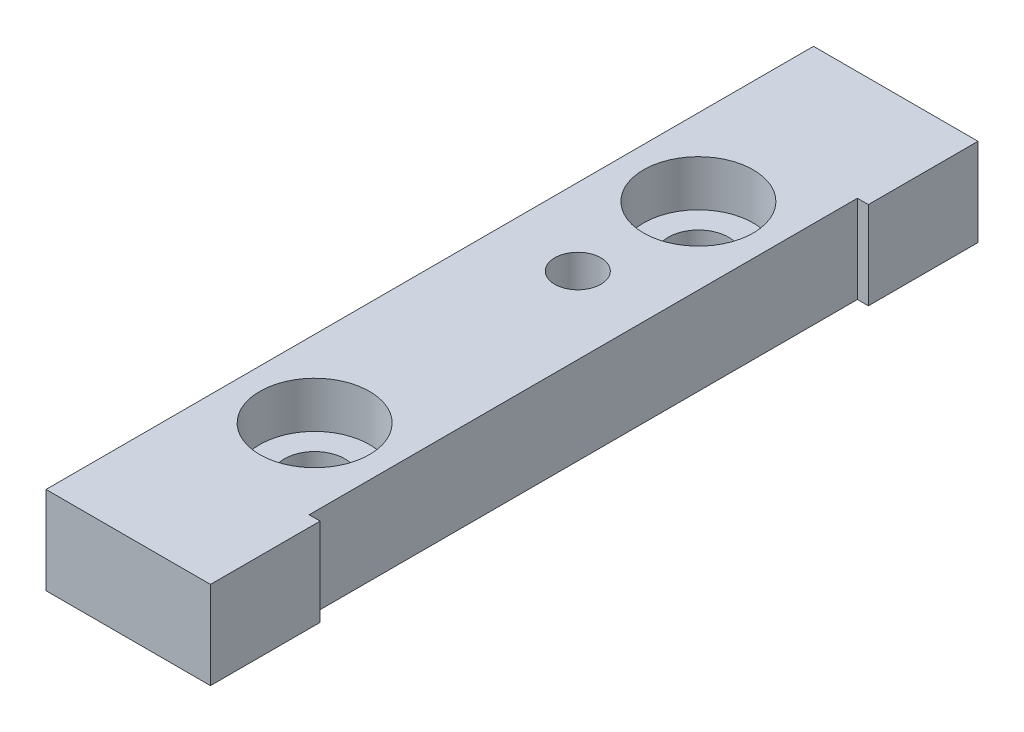
ISO-10303-21;
HEADER;
FILE_DESCRIPTION(('STEP AP214'),'2;1');
FILE_NAME('part.step','',(''),(''),'','','');
FILE_SCHEMA(('AUTOMOTIVE_DESIGN { 1 0 10303 214 1 1 1 1 }'));
ENDSEC;
DATA;
#1=APPLICATION_CONTEXT('core data for automotive mechanical design processes');
#2=APPLICATION_PROTOCOL_DEFINITION('international standard','automotive_design',2000,#1);
#3=PRODUCT_CONTEXT('',#1,'mechanical');
#4=PRODUCT('Part','Part','',(#3));
#5=PRODUCT_RELATED_PRODUCT_CATEGORY('part','',(#4));
#6=PRODUCT_DEFINITION_FORMATION('','',#4);
#7=PRODUCT_DEFINITION_CONTEXT('part definition',#1,'design');
#8=PRODUCT_DEFINITION('design','',#6,#7);
#9=PRODUCT_DEFINITION_SHAPE('','',#8);
#10=(LENGTH_UNIT() NAMED_UNIT(*) SI_UNIT(.MILLI.,.METRE.));
#11=(NAMED_UNIT(*) PLANE_ANGLE_UNIT() SI_UNIT($,.RADIAN.));
#12=(NAMED_UNIT(*) SI_UNIT($,.STERADIAN.) SOLID_ANGLE_UNIT());
#13=UNCERTAINTY_MEASURE_WITH_UNIT(LENGTH_MEASURE(1.E-05),#10,'distance_accuracy_value','');
#14=(GEOMETRIC_REPRESENTATION_CONTEXT(3) GLOBAL_UNCERTAINTY_ASSIGNED_CONTEXT((#13)) GLOBAL_UNIT_ASSIGNED_CONTEXT((#10,
#11,#12)) REPRESENTATION_CONTEXT('',''));
#15=CARTESIAN_POINT('',(0.,0.,0.));
#16=DIRECTION('',(0.,0.,1.));
#17=DIRECTION('',(1.,0.,0.));
#18=AXIS2_PLACEMENT_3D('',#15,#16,#17);
#19=CARTESIAN_POINT('',(-0.499999999999999,0.,-17.5));
#20=DIRECTION('',(0.,1.,0.));
#21=DIRECTION('',(0.,0.,1.));
#22=AXIS2_PLACEMENT_3D('',#19,#20,#21);
#23=CYLINDRICAL_SURFACE('',#22,2.75);
#24=CARTESIAN_POINT('',(-0.499999999999999,0.,-17.5));
#25=DIRECTION('',(0.,1.,0.));
#26=DIRECTION('',(0.,0.,1.));
#27=AXIS2_PLACEMENT_3D('',#24,#25,#26);
#28=CIRCLE('',#27,2.75);
#29=CARTESIAN_POINT('',(-0.499999999999999,0.,-14.75));
#30=VERTEX_POINT('',#29);
#31=EDGE_CURVE('E195',#30,#30,#28,.T.);
#32=ORIENTED_EDGE('',*,*,#31,.F.);
#33=EDGE_LOOP('',(#32));
#34=FACE_BOUND('',#33,.T.);
#35=CARTESIAN_POINT('',(-0.499999999999999,3.8,-17.5));
#36=DIRECTION('',(0.,1.,0.));
#37=DIRECTION('',(0.,0.,1.));
#38=AXIS2_PLACEMENT_3D('',#35,#36,#37);
#39=CIRCLE('',#38,2.75);
#40=CARTESIAN_POINT('',(-0.499999999999999,3.8,-14.75));
#41=VERTEX_POINT('',#40);
#42=EDGE_CURVE('E46',#41,#41,#39,.F.);
#43=ORIENTED_EDGE('',*,*,#42,.F.);
#44=EDGE_LOOP('',(#43));
#45=FACE_BOUND('',#44,.T.);
#46=ADVANCED_FACE('F42',(#34,#45),#23,.F.);
#47=CARTESIAN_POINT('',(-0.499999999999999,0.,17.5));
#48=DIRECTION('',(0.,1.,0.));
#49=DIRECTION('',(0.,0.,1.));
#50=AXIS2_PLACEMENT_3D('',#47,#48,#49);
#51=CYLINDRICAL_SURFACE('',#50,2.75);
#52=CARTESIAN_POINT('',(-0.499999999999999,0.,17.5));
#53=DIRECTION('',(0.,1.,0.));
#54=DIRECTION('',(0.,0.,1.));
#55=AXIS2_PLACEMENT_3D('',#52,#53,#54);
#56=CIRCLE('',#55,2.75);
#57=CARTESIAN_POINT('',(-0.499999999999999,0.,20.25));
#58=VERTEX_POINT('',#57);
#59=EDGE_CURVE('E151',#58,#58,#56,.T.);
#60=ORIENTED_EDGE('',*,*,#59,.F.);
#61=EDGE_LOOP('',(#60));
#62=FACE_BOUND('',#61,.T.);
#63=CARTESIAN_POINT('',(-0.499999999999999,3.8,17.5));
#64=DIRECTION('',(0.,1.,0.));
#65=DIRECTION('',(0.,0.,1.));
#66=AXIS2_PLACEMENT_3D('',#63,#64,#65);
#67=CIRCLE('',#66,2.75);
#68=CARTESIAN_POINT('',(-0.499999999999999,3.8,20.25));
#69=VERTEX_POINT('',#68);
#70=EDGE_CURVE('E186',#69,#69,#67,.F.);
#71=ORIENTED_EDGE('',*,*,#70,.F.);
#72=EDGE_LOOP('',(#71));
#73=FACE_BOUND('',#72,.T.);
#74=ADVANCED_FACE('F262',(#62,#73),#51,.F.);
#75=CARTESIAN_POINT('',(7.5,8.,-25.));
#76=DIRECTION('',(-1.,0.,0.));
#77=DIRECTION('',(0.,0.,1.));
#78=AXIS2_PLACEMENT_3D('',#75,#76,#77);
#79=PLANE('',#78);
#80=DIRECTION('',(0.,0.,-1.));
#81=VECTOR('',#80,1.);
#82=CARTESIAN_POINT('',(7.5,0.,-25.));
#83=LINE('',#82,#81);
#84=CARTESIAN_POINT('',(7.5,0.,-25.));
#85=VERTEX_POINT('',#84);
#86=CARTESIAN_POINT('',(7.5,0.,-35.));
#87=VERTEX_POINT('',#86);
#88=EDGE_CURVE('E146',#85,#87,#83,.T.);
#89=ORIENTED_EDGE('',*,*,#88,.T.);
#90=DIRECTION('',(0.,-1.,0.));
#91=VECTOR('',#90,1.);
#92=CARTESIAN_POINT('',(7.5,8.,-35.));
#93=LINE('',#92,#91);
#94=CARTESIAN_POINT('',(7.5,8.,-35.));
#95=VERTEX_POINT('',#94);
#96=EDGE_CURVE('E11',#95,#87,#93,.T.);
#97=ORIENTED_EDGE('',*,*,#96,.F.);
#98=DIRECTION('',(0.,0.,-1.));
#99=VECTOR('',#98,1.);
#100=CARTESIAN_POINT('',(7.5,8.,-25.));
#101=LINE('',#100,#99);
#102=CARTESIAN_POINT('',(7.5,8.,-25.));
#103=VERTEX_POINT('',#102);
#104=EDGE_CURVE('E169',#103,#95,#101,.T.);
#105=ORIENTED_EDGE('',*,*,#104,.F.);
#106=DIRECTION('',(0.,-1.,0.));
#107=VECTOR('',#106,1.);
#108=CARTESIAN_POINT('',(7.5,8.,-25.));
#109=LINE('',#108,#107);
#110=EDGE_CURVE('E142',#103,#85,#109,.T.);
#111=ORIENTED_EDGE('',*,*,#110,.T.);
#112=EDGE_LOOP('',(#89,#97,#105,#111));
#113=FACE_BOUND('',#112,.T.);
#114=ADVANCED_FACE('F44',(#113),#79,.F.);
#115=CARTESIAN_POINT('',(-7.5,8.,-35.));
#116=DIRECTION('',(0.,0.,1.));
#117=DIRECTION('',(1.,0.,0.));
#118=AXIS2_PLACEMENT_3D('',#115,#116,#117);
#119=PLANE('',#118);
#120=DIRECTION('',(-1.,0.,0.));
#121=VECTOR('',#120,1.);
#122=CARTESIAN_POINT('',(-7.5,0.,-35.));
#123=LINE('',#122,#121);
#124=CARTESIAN_POINT('',(-7.5,0.,-35.));
#125=VERTEX_POINT('',#124);
#126=EDGE_CURVE('E150',#87,#125,#123,.T.);
#127=ORIENTED_EDGE('',*,*,#126,.T.);
#128=DIRECTION('',(0.,-1.,0.));
#129=VECTOR('',#128,1.);
#130=CARTESIAN_POINT('',(-7.5,8.,-35.));
#131=LINE('',#130,#129);
#132=CARTESIAN_POINT('',(-7.5,8.,-35.));
#133=VERTEX_POINT('',#132);
#134=EDGE_CURVE('E53',#133,#125,#131,.T.);
#135=ORIENTED_EDGE('',*,*,#134,.F.);
#136=DIRECTION('',(-1.,0.,0.));
#137=VECTOR('',#136,1.);
#138=CARTESIAN_POINT('',(-7.5,8.,-35.));
#139=LINE('',#138,#137);
#140=EDGE_CURVE('E105',#95,#133,#139,.T.);
#141=ORIENTED_EDGE('',*,*,#140,.F.);
#142=ORIENTED_EDGE('',*,*,#96,.T.);
#143=EDGE_LOOP('',(#127,#135,#141,#142));
#144=FACE_BOUND('',#143,.T.);
#145=ADVANCED_FACE('F394',(#144),#119,.F.);
#146=CARTESIAN_POINT('',(-7.5,8.,35.));
#147=DIRECTION('',(1.,0.,0.));
#148=DIRECTION('',(0.,0.,-1.));
#149=AXIS2_PLACEMENT_3D('',#146,#147,#148);
#150=PLANE('',#149);
#151=DIRECTION('',(0.,0.,1.));
#152=VECTOR('',#151,1.);
#153=CARTESIAN_POINT('',(-7.5,0.,35.));
#154=LINE('',#153,#152);
#155=CARTESIAN_POINT('',(-7.5,0.,35.));
#156=VERTEX_POINT('',#155);
#157=EDGE_CURVE('E154',#125,#156,#154,.T.);
#158=ORIENTED_EDGE('',*,*,#157,.T.);
#159=DIRECTION('',(0.,-1.,0.));
#160=VECTOR('',#159,1.);
#161=CARTESIAN_POINT('',(-7.5,8.,35.));
#162=LINE('',#161,#160);
#163=CARTESIAN_POINT('',(-7.5,8.,35.));
#164=VERTEX_POINT('',#163);
#165=EDGE_CURVE('E180',#164,#156,#162,.T.);
#166=ORIENTED_EDGE('',*,*,#165,.F.);
#167=DIRECTION('',(0.,0.,1.));
#168=VECTOR('',#167,1.);
#169=CARTESIAN_POINT('',(-7.5,8.,35.));
#170=LINE('',#169,#168);
#171=EDGE_CURVE('E226',#133,#164,#170,.T.);
#172=ORIENTED_EDGE('',*,*,#171,.F.);
#173=ORIENTED_EDGE('',*,*,#134,.T.);
#174=EDGE_LOOP('',(#158,#166,#172,#173));
#175=FACE_BOUND('',#174,.T.);
#176=ADVANCED_FACE('F385',(#175),#150,.F.);
#177=CARTESIAN_POINT('',(-7.5,8.,35.));
#178=DIRECTION('',(0.,0.,-1.));
#179=DIRECTION('',(-1.,0.,0.));
#180=AXIS2_PLACEMENT_3D('',#177,#178,#179);
#181=PLANE('',#180);
#182=DIRECTION('',(1.,0.,0.));
#183=VECTOR('',#182,1.);
#184=CARTESIAN_POINT('',(-7.5,0.,35.));
#185=LINE('',#184,#183);
#186=CARTESIAN_POINT('',(7.5,0.,35.));
#187=VERTEX_POINT('',#186);
#188=EDGE_CURVE('E157',#156,#187,#185,.T.);
#189=ORIENTED_EDGE('',*,*,#188,.T.);
#190=DIRECTION('',(0.,-1.,0.));
#191=VECTOR('',#190,1.);
#192=CARTESIAN_POINT('',(7.5,8.,35.));
#193=LINE('',#192,#191);
#194=CARTESIAN_POINT('',(7.5,8.,35.));
#195=VERTEX_POINT('',#194);
#196=EDGE_CURVE('E176',#195,#187,#193,.T.);
#197=ORIENTED_EDGE('',*,*,#196,.F.);
#198=DIRECTION('',(1.,0.,0.));
#199=VECTOR('',#198,1.);
#200=CARTESIAN_POINT('',(-7.5,8.,35.));
#201=LINE('',#200,#199);
#202=EDGE_CURVE('E229',#164,#195,#201,.T.);
#203=ORIENTED_EDGE('',*,*,#202,.F.);
#204=ORIENTED_EDGE('',*,*,#165,.T.);
#205=EDGE_LOOP('',(#189,#197,#203,#204));
#206=FACE_BOUND('',#205,.T.);
#207=ADVANCED_FACE('F237',(#206),#181,.F.);
#208=CARTESIAN_POINT('',(7.5,8.,35.));
#209=DIRECTION('',(-1.,0.,0.));
#210=DIRECTION('',(0.,0.,1.));
#211=AXIS2_PLACEMENT_3D('',#208,#209,#210);
#212=PLANE('',#211);
#213=DIRECTION('',(0.,0.,-1.));
#214=VECTOR('',#213,1.);
#215=CARTESIAN_POINT('',(7.5,0.,35.));
#216=LINE('',#215,#214);
#217=CARTESIAN_POINT('',(7.5,0.,25.));
#218=VERTEX_POINT('',#217);
#219=EDGE_CURVE('E160',#187,#218,#216,.T.);
#220=ORIENTED_EDGE('',*,*,#219,.T.);
#221=DIRECTION('',(0.,-1.,0.));
#222=VECTOR('',#221,1.);
#223=CARTESIAN_POINT('',(7.5,8.,25.));
#224=LINE('',#223,#222);
#225=CARTESIAN_POINT('',(7.5,8.,25.));
#226=VERTEX_POINT('',#225);
#227=EDGE_CURVE('E135',#226,#218,#224,.T.);
#228=ORIENTED_EDGE('',*,*,#227,.F.);
#229=DIRECTION('',(0.,0.,-1.));
#230=VECTOR('',#229,1.);
#231=CARTESIAN_POINT('',(7.5,8.,35.));
#232=LINE('',#231,#230);
#233=EDGE_CURVE('E124',#195,#226,#232,.T.);
#234=ORIENTED_EDGE('',*,*,#233,.F.);
#235=ORIENTED_EDGE('',*,*,#196,.T.);
#236=EDGE_LOOP('',(#220,#228,#234,#235));
#237=FACE_BOUND('',#236,.T.);
#238=ADVANCED_FACE('F241',(#237),#212,.F.);
#239=CARTESIAN_POINT('',(6.50000000000001,8.,25.));
#240=DIRECTION('',(0.,0.,1.));
#241=DIRECTION('',(1.,0.,0.));
#242=AXIS2_PLACEMENT_3D('',#239,#240,#241);
#243=PLANE('',#242);
#244=DIRECTION('',(-1.,0.,0.));
#245=VECTOR('',#244,1.);
#246=CARTESIAN_POINT('',(6.50000000000001,0.,25.));
#247=LINE('',#246,#245);
#248=CARTESIAN_POINT('',(6.50000000000001,0.,25.));
#249=VERTEX_POINT('',#248);
#250=EDGE_CURVE('E133',#218,#249,#247,.T.);
#251=ORIENTED_EDGE('',*,*,#250,.T.);
#252=DIRECTION('',(0.,-1.,0.));
#253=VECTOR('',#252,1.);
#254=CARTESIAN_POINT('',(6.50000000000001,8.,25.));
#255=LINE('',#254,#253);
#256=CARTESIAN_POINT('',(6.50000000000001,8.,25.));
#257=VERTEX_POINT('',#256);
#258=EDGE_CURVE('E130',#257,#249,#255,.T.);
#259=ORIENTED_EDGE('',*,*,#258,.F.);
#260=DIRECTION('',(-1.,0.,0.));
#261=VECTOR('',#260,1.);
#262=CARTESIAN_POINT('',(6.50000000000001,8.,25.));
#263=LINE('',#262,#261);
#264=EDGE_CURVE('E118',#226,#257,#263,.T.);
#265=ORIENTED_EDGE('',*,*,#264,.F.);
#266=ORIENTED_EDGE('',*,*,#227,.T.);
#267=EDGE_LOOP('',(#251,#259,#265,#266));
#268=FACE_BOUND('',#267,.T.);
#269=ADVANCED_FACE('F131',(#268),#243,.F.);
#270=CARTESIAN_POINT('',(6.5,8.,-25.));
#271=DIRECTION('',(-1.,0.,0.));
#272=DIRECTION('',(0.,0.,1.));
#273=AXIS2_PLACEMENT_3D('',#270,#271,#272);
#274=PLANE('',#273);
#275=DIRECTION('',(0.,0.,-1.));
#276=VECTOR('',#275,1.);
#277=CARTESIAN_POINT('',(6.5,0.,-25.));
#278=LINE('',#277,#276);
#279=CARTESIAN_POINT('',(6.5,0.,-25.));
#280=VERTEX_POINT('',#279);
#281=EDGE_CURVE('E91',#249,#280,#278,.T.);
#282=ORIENTED_EDGE('',*,*,#281,.T.);
#283=DIRECTION('',(0.,-1.,0.));
#284=VECTOR('',#283,1.);
#285=CARTESIAN_POINT('',(6.5,8.,-25.));
#286=LINE('',#285,#284);
#287=CARTESIAN_POINT('',(6.5,8.,-25.));
#288=VERTEX_POINT('',#287);
#289=EDGE_CURVE('E136',#288,#280,#286,.T.);
#290=ORIENTED_EDGE('',*,*,#289,.F.);
#291=DIRECTION('',(0.,0.,-1.));
#292=VECTOR('',#291,1.);
#293=CARTESIAN_POINT('',(6.5,8.,-25.));
#294=LINE('',#293,#292);
#295=EDGE_CURVE('E122',#257,#288,#294,.T.);
#296=ORIENTED_EDGE('',*,*,#295,.F.);
#297=ORIENTED_EDGE('',*,*,#258,.T.);
#298=EDGE_LOOP('',(#282,#290,#296,#297));
#299=FACE_BOUND('',#298,.T.);
#300=ADVANCED_FACE('F138',(#299),#274,.F.);
#301=CARTESIAN_POINT('',(7.5,8.,-25.));
#302=DIRECTION('',(0.,0.,-1.));
#303=DIRECTION('',(-1.,0.,0.));
#304=AXIS2_PLACEMENT_3D('',#301,#302,#303);
#305=PLANE('',#304);
#306=DIRECTION('',(1.,0.,0.));
#307=VECTOR('',#306,1.);
#308=CARTESIAN_POINT('',(7.5,0.,-25.));
#309=LINE('',#308,#307);
#310=EDGE_CURVE('E97',#280,#85,#309,.T.);
#311=ORIENTED_EDGE('',*,*,#310,.T.);
#312=ORIENTED_EDGE('',*,*,#110,.F.);
#313=DIRECTION('',(1.,0.,0.));
#314=VECTOR('',#313,1.);
#315=CARTESIAN_POINT('',(7.5,8.,-25.));
#316=LINE('',#315,#314);
#317=EDGE_CURVE('E62',#288,#103,#316,.T.);
#318=ORIENTED_EDGE('',*,*,#317,.F.);
#319=ORIENTED_EDGE('',*,*,#289,.T.);
#320=EDGE_LOOP('',(#311,#312,#318,#319));
#321=FACE_BOUND('',#320,.T.);
#322=ADVANCED_FACE('F249',(#321),#305,.F.);
#323=CARTESIAN_POINT('',(0.,8.,0.));
#324=DIRECTION('',(0.,-1.,0.));
#325=DIRECTION('',(0.,0.,-1.));
#326=AXIS2_PLACEMENT_3D('',#323,#324,#325);
#327=PLANE('',#326);
#328=CARTESIAN_POINT('',(-0.499999999999999,8.,-6.5));
#329=DIRECTION('',(0.,1.,0.));
#330=DIRECTION('',(0.,0.,1.));
#331=AXIS2_PLACEMENT_3D('',#328,#329,#330);
#332=CIRCLE('',#331,2.09999999999999);
#333=CARTESIAN_POINT('',(-0.499999999999999,8.,-4.40000000000001));
#334=VERTEX_POINT('',#333);
#335=EDGE_CURVE('E292',#334,#334,#332,.T.);
#336=ORIENTED_EDGE('',*,*,#335,.F.);
#337=EDGE_LOOP('',(#336));
#338=FACE_BOUND('',#337,.T.);
#339=CARTESIAN_POINT('',(-0.499999999999999,8.,-17.5));
#340=DIRECTION('',(0.,1.,0.));
#341=DIRECTION('',(0.,0.,1.));
#342=AXIS2_PLACEMENT_3D('',#339,#340,#341);
#343=CIRCLE('',#342,5.);
#344=CARTESIAN_POINT('',(-0.499999999999999,8.,-12.5));
#345=VERTEX_POINT('',#344);
#346=EDGE_CURVE('E197',#345,#345,#343,.T.);
#347=ORIENTED_EDGE('',*,*,#346,.F.);
#348=EDGE_LOOP('',(#347));
#349=FACE_BOUND('',#348,.T.);
#350=CARTESIAN_POINT('',(-0.499999999999999,8.,17.5));
#351=DIRECTION('',(0.,1.,0.));
#352=DIRECTION('',(0.,0.,1.));
#353=AXIS2_PLACEMENT_3D('',#350,#351,#352);
#354=CIRCLE('',#353,5.);
#355=CARTESIAN_POINT('',(-0.499999999999999,8.,22.5));
#356=VERTEX_POINT('',#355);
#357=EDGE_CURVE('E212',#356,#356,#354,.T.);
#358=ORIENTED_EDGE('',*,*,#357,.F.);
#359=EDGE_LOOP('',(#358));
#360=FACE_BOUND('',#359,.T.);
#361=ORIENTED_EDGE('',*,*,#104,.T.);
#362=ORIENTED_EDGE('',*,*,#140,.T.);
#363=ORIENTED_EDGE('',*,*,#171,.T.);
#364=ORIENTED_EDGE('',*,*,#202,.T.);
#365=ORIENTED_EDGE('',*,*,#233,.T.);
#366=ORIENTED_EDGE('',*,*,#264,.T.);
#367=ORIENTED_EDGE('',*,*,#295,.T.);
#368=ORIENTED_EDGE('',*,*,#317,.T.);
#369=EDGE_LOOP('',(#361,#362,#363,#364,#365,#366,#367,#368));
#370=FACE_BOUND('',#369,.T.);
#371=ADVANCED_FACE('F120',(#338,#349,#360,#370),#327,.F.);
#372=CARTESIAN_POINT('',(0.,0.,0.));
#373=DIRECTION('',(0.,-1.,0.));
#374=DIRECTION('',(0.,0.,-1.));
#375=AXIS2_PLACEMENT_3D('',#372,#373,#374);
#376=PLANE('',#375);
#377=CARTESIAN_POINT('',(-0.499999999999999,0.,-6.5));
#378=DIRECTION('',(0.,1.,0.));
#379=DIRECTION('',(0.,0.,1.));
#380=AXIS2_PLACEMENT_3D('',#377,#378,#379);
#381=CIRCLE('',#380,2.1);
#382=CARTESIAN_POINT('',(-0.499999999999999,0.,-4.4));
#383=VERTEX_POINT('',#382);
#384=EDGE_CURVE('E206',#383,#383,#381,.T.);
#385=ORIENTED_EDGE('',*,*,#384,.T.);
#386=EDGE_LOOP('',(#385));
#387=FACE_BOUND('',#386,.T.);
#388=ORIENTED_EDGE('',*,*,#59,.T.);
#389=EDGE_LOOP('',(#388));
#390=FACE_BOUND('',#389,.T.);
#391=ORIENTED_EDGE('',*,*,#31,.T.);
#392=EDGE_LOOP('',(#391));
#393=FACE_BOUND('',#392,.T.);
#394=ORIENTED_EDGE('',*,*,#88,.F.);
#395=ORIENTED_EDGE('',*,*,#310,.F.);
#396=ORIENTED_EDGE('',*,*,#281,.F.);
#397=ORIENTED_EDGE('',*,*,#250,.F.);
#398=ORIENTED_EDGE('',*,*,#219,.F.);
#399=ORIENTED_EDGE('',*,*,#188,.F.);
#400=ORIENTED_EDGE('',*,*,#157,.F.);
#401=ORIENTED_EDGE('',*,*,#126,.F.);
#402=EDGE_LOOP('',(#394,#395,#396,#397,#398,#399,#400,#401));
#403=FACE_BOUND('',#402,.T.);
#404=ADVANCED_FACE('F244',(#387,#390,#393,#403),#376,.T.);
#405=CARTESIAN_POINT('',(-0.499999999999999,3.8,17.5));
#406=DIRECTION('',(0.,1.,0.));
#407=DIRECTION('',(0.,0.,1.));
#408=AXIS2_PLACEMENT_3D('',#405,#406,#407);
#409=PLANE('',#408);
#410=CARTESIAN_POINT('',(-0.499999999999999,3.8,17.5));
#411=DIRECTION('',(0.,1.,0.));
#412=DIRECTION('',(0.,0.,1.));
#413=AXIS2_PLACEMENT_3D('',#410,#411,#412);
#414=CIRCLE('',#413,5.);
#415=CARTESIAN_POINT('',(-0.499999999999999,3.8,22.5));
#416=VERTEX_POINT('',#415);
#417=EDGE_CURVE('E203',#416,#416,#414,.T.);
#418=ORIENTED_EDGE('',*,*,#417,.T.);
#419=EDGE_LOOP('',(#418));
#420=FACE_BOUND('',#419,.T.);
#421=ORIENTED_EDGE('',*,*,#70,.T.);
#422=EDGE_LOOP('',(#421));
#423=FACE_BOUND('',#422,.T.);
#424=ADVANCED_FACE('F274',(#420,#423),#409,.T.);
#425=CARTESIAN_POINT('',(-0.499999999999999,3.8,17.5));
#426=DIRECTION('',(0.,1.,0.));
#427=DIRECTION('',(0.,0.,1.));
#428=AXIS2_PLACEMENT_3D('',#425,#426,#427);
#429=CYLINDRICAL_SURFACE('',#428,5.);
#430=ORIENTED_EDGE('',*,*,#417,.F.);
#431=EDGE_LOOP('',(#430));
#432=FACE_BOUND('',#431,.T.);
#433=ORIENTED_EDGE('',*,*,#357,.T.);
#434=EDGE_LOOP('',(#433));
#435=FACE_BOUND('',#434,.T.);
#436=ADVANCED_FACE('F281',(#432,#435),#429,.F.);
#437=CARTESIAN_POINT('',(-0.499999999999999,3.8,-17.5));
#438=DIRECTION('',(0.,1.,0.));
#439=DIRECTION('',(0.,0.,1.));
#440=AXIS2_PLACEMENT_3D('',#437,#438,#439);
#441=PLANE('',#440);
#442=CARTESIAN_POINT('',(-0.499999999999999,3.8,-17.5));
#443=DIRECTION('',(0.,1.,0.));
#444=DIRECTION('',(0.,0.,1.));
#445=AXIS2_PLACEMENT_3D('',#442,#443,#444);
#446=CIRCLE('',#445,5.);
#447=CARTESIAN_POINT('',(-0.499999999999999,3.8,-12.5));
#448=VERTEX_POINT('',#447);
#449=EDGE_CURVE('E189',#448,#448,#446,.T.);
#450=ORIENTED_EDGE('',*,*,#449,.T.);
#451=EDGE_LOOP('',(#450));
#452=FACE_BOUND('',#451,.T.);
#453=ORIENTED_EDGE('',*,*,#42,.T.);
#454=EDGE_LOOP('',(#453));
#455=FACE_BOUND('',#454,.T.);
#456=ADVANCED_FACE('F304',(#452,#455),#441,.T.);
#457=CARTESIAN_POINT('',(-0.499999999999999,3.8,-17.5));
#458=DIRECTION('',(0.,1.,0.));
#459=DIRECTION('',(0.,0.,1.));
#460=AXIS2_PLACEMENT_3D('',#457,#458,#459);
#461=CYLINDRICAL_SURFACE('',#460,5.);
#462=ORIENTED_EDGE('',*,*,#449,.F.);
#463=EDGE_LOOP('',(#462));
#464=FACE_BOUND('',#463,.T.);
#465=ORIENTED_EDGE('',*,*,#346,.T.);
#466=EDGE_LOOP('',(#465));
#467=FACE_BOUND('',#466,.T.);
#468=ADVANCED_FACE('F309',(#464,#467),#461,.F.);
#469=CARTESIAN_POINT('',(-0.499999999999999,8.,-6.5));
#470=DIRECTION('',(0.,1.,0.));
#471=DIRECTION('',(0.,0.,1.));
#472=AXIS2_PLACEMENT_3D('',#469,#470,#471);
#473=CYLINDRICAL_SURFACE('',#472,2.09999999999999);
#474=ORIENTED_EDGE('',*,*,#384,.F.);
#475=EDGE_LOOP('',(#474));
#476=FACE_BOUND('',#475,.T.);
#477=ORIENTED_EDGE('',*,*,#335,.T.);
#478=EDGE_LOOP('',(#477));
#479=FACE_BOUND('',#478,.T.);
#480=ADVANCED_FACE('F297',(#476,#479),#473,.F.);
#481=CLOSED_SHELL('',(#46,#74,#114,#145,#176,#207,#238,#269,#300,#322,#371,#404,#424,#436,#456,
#468,#480));
#482=MANIFOLD_SOLID_BREP('B2',#481);
#483=ADVANCED_BREP_SHAPE_REPRESENTATION('',(#18,#482),#14);
#484=SHAPE_DEFINITION_REPRESENTATION(#9,#483);
ENDSEC;
END-ISO-10303-21;
